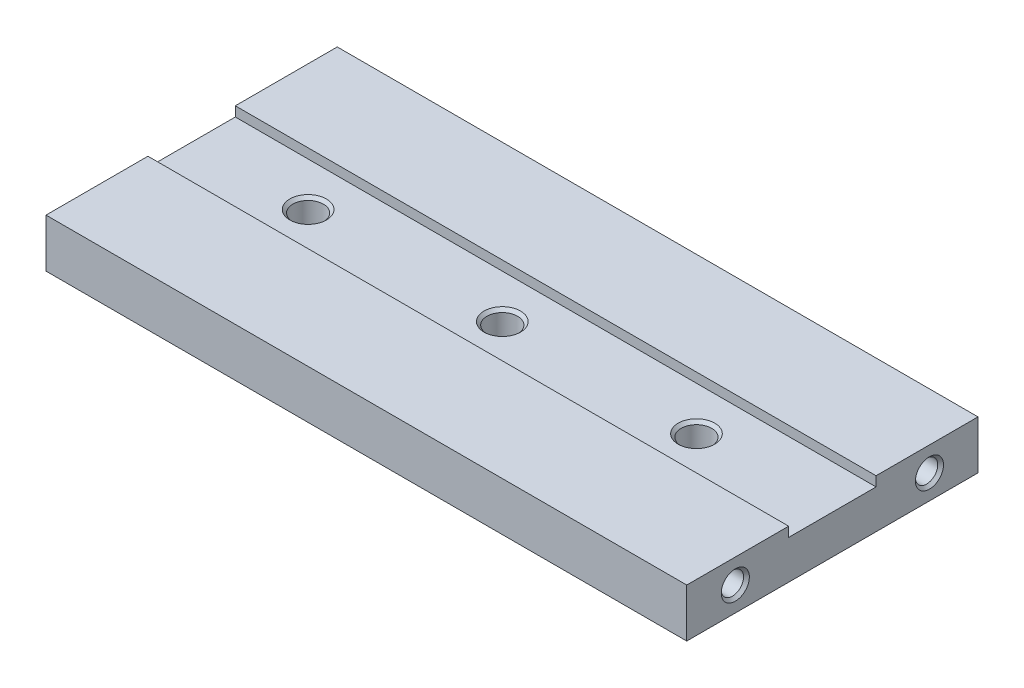
ISO-10303-21;
HEADER;
FILE_DESCRIPTION(('STEP AP214'),'2;1');
FILE_NAME('part.step','',(''),(''),'','','');
FILE_SCHEMA(('AUTOMOTIVE_DESIGN { 1 0 10303 214 1 1 1 1 }'));
ENDSEC;
DATA;
#1=APPLICATION_CONTEXT('core data for automotive mechanical design processes');
#2=APPLICATION_PROTOCOL_DEFINITION('international standard','automotive_design',2000,#1);
#3=PRODUCT_CONTEXT('',#1,'mechanical');
#4=PRODUCT('Part','Part','',(#3));
#5=PRODUCT_RELATED_PRODUCT_CATEGORY('part','',(#4));
#6=PRODUCT_DEFINITION_FORMATION('','',#4);
#7=PRODUCT_DEFINITION_CONTEXT('part definition',#1,'design');
#8=PRODUCT_DEFINITION('design','',#6,#7);
#9=PRODUCT_DEFINITION_SHAPE('','',#8);
#10=(LENGTH_UNIT() NAMED_UNIT(*) SI_UNIT(.MILLI.,.METRE.));
#11=(NAMED_UNIT(*) PLANE_ANGLE_UNIT() SI_UNIT($,.RADIAN.));
#12=(NAMED_UNIT(*) SI_UNIT($,.STERADIAN.) SOLID_ANGLE_UNIT());
#13=UNCERTAINTY_MEASURE_WITH_UNIT(LENGTH_MEASURE(1.E-05),#10,'distance_accuracy_value','');
#14=(GEOMETRIC_REPRESENTATION_CONTEXT(3) GLOBAL_UNCERTAINTY_ASSIGNED_CONTEXT((#13)) GLOBAL_UNIT_ASSIGNED_CONTEXT((#10,
#11,#12)) REPRESENTATION_CONTEXT('',''));
#15=CARTESIAN_POINT('',(0.,0.,0.));
#16=DIRECTION('',(0.,0.,1.));
#17=DIRECTION('',(1.,0.,0.));
#18=AXIS2_PLACEMENT_3D('',#15,#16,#17);
#19=CARTESIAN_POINT('',(0.,5.,0.));
#20=DIRECTION('',(0.,1.,0.));
#21=DIRECTION('',(0.,0.,1.));
#22=AXIS2_PLACEMENT_3D('',#19,#20,#21);
#23=PLANE('',#22);
#24=DIRECTION('',(-1.,0.,0.));
#25=VECTOR('',#24,1.);
#26=CARTESIAN_POINT('',(33.,5.,-4.5));
#27=LINE('',#26,#25);
#28=CARTESIAN_POINT('',(33.,5.,-4.5));
#29=VERTEX_POINT('',#28);
#30=CARTESIAN_POINT('',(-33.,5.,-4.5));
#31=VERTEX_POINT('',#30);
#32=EDGE_CURVE('E191',#29,#31,#27,.T.);
#33=ORIENTED_EDGE('',*,*,#32,.F.);
#34=DIRECTION('',(0.,0.,-1.));
#35=VECTOR('',#34,1.);
#36=CARTESIAN_POINT('',(33.,5.,15.));
#37=LINE('',#36,#35);
#38=CARTESIAN_POINT('',(33.,5.,-15.));
#39=VERTEX_POINT('',#38);
#40=EDGE_CURVE('E226',#29,#39,#37,.T.);
#41=ORIENTED_EDGE('',*,*,#40,.T.);
#42=DIRECTION('',(-1.,0.,0.));
#43=VECTOR('',#42,1.);
#44=CARTESIAN_POINT('',(33.,5.,-15.));
#45=LINE('',#44,#43);
#46=CARTESIAN_POINT('',(-33.,5.,-15.));
#47=VERTEX_POINT('',#46);
#48=EDGE_CURVE('E69',#39,#47,#45,.T.);
#49=ORIENTED_EDGE('',*,*,#48,.T.);
#50=DIRECTION('',(0.,0.,1.));
#51=VECTOR('',#50,1.);
#52=CARTESIAN_POINT('',(-33.,5.,15.));
#53=LINE('',#52,#51);
#54=EDGE_CURVE('E220',#47,#31,#53,.T.);
#55=ORIENTED_EDGE('',*,*,#54,.T.);
#56=EDGE_LOOP('',(#33,#41,#49,#55));
#57=FACE_BOUND('',#56,.T.);
#58=ADVANCED_FACE('F44',(#57),#23,.T.);
#59=CARTESIAN_POINT('',(-33.,5.,15.));
#60=DIRECTION('',(1.,0.,0.));
#61=DIRECTION('',(0.,0.,-1.));
#62=AXIS2_PLACEMENT_3D('',#59,#60,#61);
#63=PLANE('',#62);
#64=CARTESIAN_POINT('',(-33.,2.5,-9.99999999999999));
#65=DIRECTION('',(-1.,0.,0.));
#66=DIRECTION('',(0.,0.,1.));
#67=AXIS2_PLACEMENT_3D('',#64,#65,#66);
#68=CIRCLE('',#67,1.4475);
#69=CARTESIAN_POINT('',(-33.,2.5,-8.55249999999999));
#70=VERTEX_POINT('',#69);
#71=EDGE_CURVE('E150',#70,#70,#68,.T.);
#72=ORIENTED_EDGE('',*,*,#71,.F.);
#73=EDGE_LOOP('',(#72));
#74=FACE_BOUND('',#73,.T.);
#75=CARTESIAN_POINT('',(-33.,2.5,10.));
#76=DIRECTION('',(-1.,0.,0.));
#77=DIRECTION('',(0.,0.,1.));
#78=AXIS2_PLACEMENT_3D('',#75,#76,#77);
#79=CIRCLE('',#78,1.4475);
#80=CARTESIAN_POINT('',(-33.,2.5,11.4475));
#81=VERTEX_POINT('',#80);
#82=EDGE_CURVE('E141',#81,#81,#79,.T.);
#83=ORIENTED_EDGE('',*,*,#82,.F.);
#84=EDGE_LOOP('',(#83));
#85=FACE_BOUND('',#84,.T.);
#86=DIRECTION('',(0.,0.,1.));
#87=VECTOR('',#86,1.);
#88=CARTESIAN_POINT('',(-33.,4.,4.5));
#89=LINE('',#88,#87);
#90=CARTESIAN_POINT('',(-33.,4.,-4.5));
#91=VERTEX_POINT('',#90);
#92=CARTESIAN_POINT('',(-33.,4.,4.5));
#93=VERTEX_POINT('',#92);
#94=EDGE_CURVE('E186',#91,#93,#89,.T.);
#95=ORIENTED_EDGE('',*,*,#94,.F.);
#96=DIRECTION('',(0.,1.,0.));
#97=VECTOR('',#96,1.);
#98=CARTESIAN_POINT('',(-33.,4.,-4.5));
#99=LINE('',#98,#97);
#100=EDGE_CURVE('E206',#91,#31,#99,.T.);
#101=ORIENTED_EDGE('',*,*,#100,.T.);
#102=ORIENTED_EDGE('',*,*,#54,.F.);
#103=DIRECTION('',(0.,-1.,0.));
#104=VECTOR('',#103,1.);
#105=CARTESIAN_POINT('',(-33.,5.,-15.));
#106=LINE('',#105,#104);
#107=CARTESIAN_POINT('',(-33.,0.,-15.));
#108=VERTEX_POINT('',#107);
#109=EDGE_CURVE('E233',#47,#108,#106,.T.);
#110=ORIENTED_EDGE('',*,*,#109,.T.);
#111=DIRECTION('',(0.,0.,1.));
#112=VECTOR('',#111,1.);
#113=CARTESIAN_POINT('',(-33.,0.,15.));
#114=LINE('',#113,#112);
#115=CARTESIAN_POINT('',(-33.,0.,15.));
#116=VERTEX_POINT('',#115);
#117=EDGE_CURVE('E210',#108,#116,#114,.T.);
#118=ORIENTED_EDGE('',*,*,#117,.T.);
#119=DIRECTION('',(0.,-1.,0.));
#120=VECTOR('',#119,1.);
#121=CARTESIAN_POINT('',(-33.,5.,15.));
#122=LINE('',#121,#120);
#123=CARTESIAN_POINT('',(-33.,5.,15.));
#124=VERTEX_POINT('',#123);
#125=EDGE_CURVE('E11',#124,#116,#122,.T.);
#126=ORIENTED_EDGE('',*,*,#125,.F.);
#127=CARTESIAN_POINT('',(-33.,5.,4.5));
#128=VERTEX_POINT('',#127);
#129=EDGE_CURVE('E97',#128,#124,#53,.T.);
#130=ORIENTED_EDGE('',*,*,#129,.F.);
#131=DIRECTION('',(0.,1.,0.));
#132=VECTOR('',#131,1.);
#133=CARTESIAN_POINT('',(-33.,4.,4.5));
#134=LINE('',#133,#132);
#135=EDGE_CURVE('E60',#93,#128,#134,.T.);
#136=ORIENTED_EDGE('',*,*,#135,.F.);
#137=EDGE_LOOP('',(#95,#101,#102,#110,#118,#126,#130,#136));
#138=FACE_BOUND('',#137,.T.);
#139=ADVANCED_FACE('F46',(#74,#85,#138),#63,.F.);
#140=CARTESIAN_POINT('',(33.,5.,15.));
#141=DIRECTION('',(0.,0.,-1.));
#142=DIRECTION('',(-1.,0.,0.));
#143=AXIS2_PLACEMENT_3D('',#140,#141,#142);
#144=PLANE('',#143);
#145=DIRECTION('',(1.,0.,0.));
#146=VECTOR('',#145,1.);
#147=CARTESIAN_POINT('',(33.,0.,15.));
#148=LINE('',#147,#146);
#149=CARTESIAN_POINT('',(33.,0.,15.));
#150=VERTEX_POINT('',#149);
#151=EDGE_CURVE('E237',#116,#150,#148,.T.);
#152=ORIENTED_EDGE('',*,*,#151,.T.);
#153=DIRECTION('',(0.,-1.,0.));
#154=VECTOR('',#153,1.);
#155=CARTESIAN_POINT('',(33.,5.,15.));
#156=LINE('',#155,#154);
#157=CARTESIAN_POINT('',(33.,5.,15.));
#158=VERTEX_POINT('',#157);
#159=EDGE_CURVE('E53',#158,#150,#156,.T.);
#160=ORIENTED_EDGE('',*,*,#159,.F.);
#161=DIRECTION('',(1.,0.,0.));
#162=VECTOR('',#161,1.);
#163=CARTESIAN_POINT('',(33.,5.,15.));
#164=LINE('',#163,#162);
#165=EDGE_CURVE('E223',#124,#158,#164,.T.);
#166=ORIENTED_EDGE('',*,*,#165,.F.);
#167=ORIENTED_EDGE('',*,*,#125,.T.);
#168=EDGE_LOOP('',(#152,#160,#166,#167));
#169=FACE_BOUND('',#168,.T.);
#170=ADVANCED_FACE('F278',(#169),#144,.F.);
#171=CARTESIAN_POINT('',(33.,5.,15.));
#172=DIRECTION('',(-1.,0.,0.));
#173=DIRECTION('',(0.,0.,1.));
#174=AXIS2_PLACEMENT_3D('',#171,#172,#173);
#175=PLANE('',#174);
#176=CARTESIAN_POINT('',(33.,2.5,9.99999999999999));
#177=DIRECTION('',(1.,0.,0.));
#178=DIRECTION('',(0.,0.,-1.));
#179=AXIS2_PLACEMENT_3D('',#176,#177,#178);
#180=CIRCLE('',#179,1.4475);
#181=CARTESIAN_POINT('',(33.,2.5,8.5525));
#182=VERTEX_POINT('',#181);
#183=EDGE_CURVE('E161',#182,#182,#180,.T.);
#184=ORIENTED_EDGE('',*,*,#183,.F.);
#185=EDGE_LOOP('',(#184));
#186=FACE_BOUND('',#185,.T.);
#187=CARTESIAN_POINT('',(33.,2.5,-10.));
#188=DIRECTION('',(1.,0.,0.));
#189=DIRECTION('',(0.,0.,-1.));
#190=AXIS2_PLACEMENT_3D('',#187,#188,#189);
#191=CIRCLE('',#190,1.4475);
#192=CARTESIAN_POINT('',(33.,2.5,-11.4475));
#193=VERTEX_POINT('',#192);
#194=EDGE_CURVE('E173',#193,#193,#191,.T.);
#195=ORIENTED_EDGE('',*,*,#194,.F.);
#196=EDGE_LOOP('',(#195));
#197=FACE_BOUND('',#196,.T.);
#198=ORIENTED_EDGE('',*,*,#40,.F.);
#199=DIRECTION('',(0.,1.,0.));
#200=VECTOR('',#199,1.);
#201=CARTESIAN_POINT('',(33.,4.,-4.5));
#202=LINE('',#201,#200);
#203=CARTESIAN_POINT('',(33.,4.,-4.5));
#204=VERTEX_POINT('',#203);
#205=EDGE_CURVE('E211',#204,#29,#202,.T.);
#206=ORIENTED_EDGE('',*,*,#205,.F.);
#207=DIRECTION('',(0.,0.,-1.));
#208=VECTOR('',#207,1.);
#209=CARTESIAN_POINT('',(33.,4.,4.5));
#210=LINE('',#209,#208);
#211=CARTESIAN_POINT('',(33.,4.,4.5));
#212=VERTEX_POINT('',#211);
#213=EDGE_CURVE('E195',#212,#204,#210,.T.);
#214=ORIENTED_EDGE('',*,*,#213,.F.);
#215=DIRECTION('',(0.,1.,0.));
#216=VECTOR('',#215,1.);
#217=CARTESIAN_POINT('',(33.,4.,4.5));
#218=LINE('',#217,#216);
#219=CARTESIAN_POINT('',(33.,5.,4.5));
#220=VERTEX_POINT('',#219);
#221=EDGE_CURVE('E214',#212,#220,#218,.T.);
#222=ORIENTED_EDGE('',*,*,#221,.T.);
#223=EDGE_CURVE('E227',#158,#220,#37,.T.);
#224=ORIENTED_EDGE('',*,*,#223,.F.);
#225=ORIENTED_EDGE('',*,*,#159,.T.);
#226=DIRECTION('',(0.,0.,-1.));
#227=VECTOR('',#226,1.);
#228=CARTESIAN_POINT('',(33.,0.,15.));
#229=LINE('',#228,#227);
#230=CARTESIAN_POINT('',(33.,0.,-15.));
#231=VERTEX_POINT('',#230);
#232=EDGE_CURVE('E240',#150,#231,#229,.T.);
#233=ORIENTED_EDGE('',*,*,#232,.T.);
#234=DIRECTION('',(0.,-1.,0.));
#235=VECTOR('',#234,1.);
#236=CARTESIAN_POINT('',(33.,5.,-15.));
#237=LINE('',#236,#235);
#238=EDGE_CURVE('E247',#39,#231,#237,.T.);
#239=ORIENTED_EDGE('',*,*,#238,.F.);
#240=EDGE_LOOP('',(#198,#206,#214,#222,#224,#225,#233,#239));
#241=FACE_BOUND('',#240,.T.);
#242=ADVANCED_FACE('F256',(#186,#197,#241),#175,.F.);
#243=CARTESIAN_POINT('',(33.,5.,-15.));
#244=DIRECTION('',(0.,0.,1.));
#245=DIRECTION('',(1.,0.,0.));
#246=AXIS2_PLACEMENT_3D('',#243,#244,#245);
#247=PLANE('',#246);
#248=DIRECTION('',(-1.,0.,0.));
#249=VECTOR('',#248,1.);
#250=CARTESIAN_POINT('',(33.,0.,-15.));
#251=LINE('',#250,#249);
#252=EDGE_CURVE('E90',#231,#108,#251,.T.);
#253=ORIENTED_EDGE('',*,*,#252,.T.);
#254=ORIENTED_EDGE('',*,*,#109,.F.);
#255=ORIENTED_EDGE('',*,*,#48,.F.);
#256=ORIENTED_EDGE('',*,*,#238,.T.);
#257=EDGE_LOOP('',(#253,#254,#255,#256));
#258=FACE_BOUND('',#257,.T.);
#259=ADVANCED_FACE('F266',(#258),#247,.F.);
#260=DIRECTION('',(1.,0.,0.));
#261=VECTOR('',#260,1.);
#262=CARTESIAN_POINT('',(33.,5.,4.5));
#263=LINE('',#262,#261);
#264=EDGE_CURVE('E185',#128,#220,#263,.T.);
#265=ORIENTED_EDGE('',*,*,#264,.F.);
#266=ORIENTED_EDGE('',*,*,#129,.T.);
#267=ORIENTED_EDGE('',*,*,#165,.T.);
#268=ORIENTED_EDGE('',*,*,#223,.T.);
#269=EDGE_LOOP('',(#265,#266,#267,#268));
#270=FACE_BOUND('',#269,.T.);
#271=ADVANCED_FACE('F277',(#270),#23,.T.);
#272=CARTESIAN_POINT('',(0.,0.,0.));
#273=DIRECTION('',(0.,1.,0.));
#274=DIRECTION('',(0.,0.,1.));
#275=AXIS2_PLACEMENT_3D('',#272,#273,#274);
#276=PLANE('',#275);
#277=CARTESIAN_POINT('',(-21.,0.,0.));
#278=DIRECTION('',(0.,1.,0.));
#279=DIRECTION('',(0.,0.,1.));
#280=AXIS2_PLACEMENT_3D('',#277,#278,#279);
#281=CIRCLE('',#280,1.575);
#282=CARTESIAN_POINT('',(-21.,0.,1.575));
#283=VERTEX_POINT('',#282);
#284=EDGE_CURVE('E622',#283,#283,#281,.T.);
#285=ORIENTED_EDGE('',*,*,#284,.T.);
#286=EDGE_LOOP('',(#285));
#287=FACE_BOUND('',#286,.T.);
#288=CARTESIAN_POINT('',(-1.,0.,0.));
#289=DIRECTION('',(0.,1.,0.));
#290=DIRECTION('',(0.,0.,1.));
#291=AXIS2_PLACEMENT_3D('',#288,#289,#290);
#292=CIRCLE('',#291,1.575);
#293=CARTESIAN_POINT('',(-1.,0.,1.575));
#294=VERTEX_POINT('',#293);
#295=EDGE_CURVE('E636',#294,#294,#292,.T.);
#296=ORIENTED_EDGE('',*,*,#295,.T.);
#297=EDGE_LOOP('',(#296));
#298=FACE_BOUND('',#297,.T.);
#299=CARTESIAN_POINT('',(19.,0.,0.));
#300=DIRECTION('',(0.,1.,0.));
#301=DIRECTION('',(0.,0.,1.));
#302=AXIS2_PLACEMENT_3D('',#299,#300,#301);
#303=CIRCLE('',#302,1.575);
#304=CARTESIAN_POINT('',(19.,0.,1.575));
#305=VERTEX_POINT('',#304);
#306=EDGE_CURVE('E648',#305,#305,#303,.T.);
#307=ORIENTED_EDGE('',*,*,#306,.T.);
#308=EDGE_LOOP('',(#307));
#309=FACE_BOUND('',#308,.T.);
#310=ORIENTED_EDGE('',*,*,#117,.F.);
#311=ORIENTED_EDGE('',*,*,#252,.F.);
#312=ORIENTED_EDGE('',*,*,#232,.F.);
#313=ORIENTED_EDGE('',*,*,#151,.F.);
#314=EDGE_LOOP('',(#310,#311,#312,#313));
#315=FACE_BOUND('',#314,.T.);
#316=ADVANCED_FACE('F261',(#287,#298,#309,#315),#276,.F.);
#317=CARTESIAN_POINT('',(33.,4.,-4.5));
#318=DIRECTION('',(0.,0.,-1.));
#319=DIRECTION('',(-1.,0.,0.));
#320=AXIS2_PLACEMENT_3D('',#317,#318,#319);
#321=PLANE('',#320);
#322=ORIENTED_EDGE('',*,*,#32,.T.);
#323=ORIENTED_EDGE('',*,*,#100,.F.);
#324=DIRECTION('',(-1.,0.,0.));
#325=VECTOR('',#324,1.);
#326=CARTESIAN_POINT('',(33.,4.,-4.5));
#327=LINE('',#326,#325);
#328=EDGE_CURVE('E198',#204,#91,#327,.T.);
#329=ORIENTED_EDGE('',*,*,#328,.F.);
#330=ORIENTED_EDGE('',*,*,#205,.T.);
#331=EDGE_LOOP('',(#322,#323,#329,#330));
#332=FACE_BOUND('',#331,.T.);
#333=ADVANCED_FACE('F273',(#332),#321,.F.);
#334=CARTESIAN_POINT('',(33.,4.,4.5));
#335=DIRECTION('',(0.,0.,1.));
#336=DIRECTION('',(1.,0.,0.));
#337=AXIS2_PLACEMENT_3D('',#334,#335,#336);
#338=PLANE('',#337);
#339=ORIENTED_EDGE('',*,*,#264,.T.);
#340=ORIENTED_EDGE('',*,*,#221,.F.);
#341=DIRECTION('',(1.,0.,0.));
#342=VECTOR('',#341,1.);
#343=CARTESIAN_POINT('',(33.,4.,4.5));
#344=LINE('',#343,#342);
#345=EDGE_CURVE('E190',#93,#212,#344,.T.);
#346=ORIENTED_EDGE('',*,*,#345,.F.);
#347=ORIENTED_EDGE('',*,*,#135,.T.);
#348=EDGE_LOOP('',(#339,#340,#346,#347));
#349=FACE_BOUND('',#348,.T.);
#350=ADVANCED_FACE('F313',(#349),#338,.F.);
#351=CARTESIAN_POINT('',(0.,4.,0.));
#352=DIRECTION('',(0.,1.,0.));
#353=DIRECTION('',(0.,0.,1.));
#354=AXIS2_PLACEMENT_3D('',#351,#352,#353);
#355=PLANE('',#354);
#356=CARTESIAN_POINT('',(-21.,4.,0.));
#357=DIRECTION('',(0.,1.,0.));
#358=DIRECTION('',(0.,0.,1.));
#359=AXIS2_PLACEMENT_3D('',#356,#357,#358);
#360=CIRCLE('',#359,1.883);
#361=CARTESIAN_POINT('',(-21.,4.,1.883));
#362=VERTEX_POINT('',#361);
#363=EDGE_CURVE('E618',#362,#362,#360,.T.);
#364=ORIENTED_EDGE('',*,*,#363,.F.);
#365=EDGE_LOOP('',(#364));
#366=FACE_BOUND('',#365,.T.);
#367=CARTESIAN_POINT('',(-1.,4.,0.));
#368=DIRECTION('',(0.,1.,0.));
#369=DIRECTION('',(0.,0.,1.));
#370=AXIS2_PLACEMENT_3D('',#367,#368,#369);
#371=CIRCLE('',#370,1.883);
#372=CARTESIAN_POINT('',(-1.,4.,1.883));
#373=VERTEX_POINT('',#372);
#374=EDGE_CURVE('E628',#373,#373,#371,.T.);
#375=ORIENTED_EDGE('',*,*,#374,.F.);
#376=EDGE_LOOP('',(#375));
#377=FACE_BOUND('',#376,.T.);
#378=CARTESIAN_POINT('',(19.,4.,0.));
#379=DIRECTION('',(0.,1.,0.));
#380=DIRECTION('',(0.,0.,1.));
#381=AXIS2_PLACEMENT_3D('',#378,#379,#380);
#382=CIRCLE('',#381,1.883);
#383=CARTESIAN_POINT('',(19.,4.,1.883));
#384=VERTEX_POINT('',#383);
#385=EDGE_CURVE('E640',#384,#384,#382,.T.);
#386=ORIENTED_EDGE('',*,*,#385,.F.);
#387=EDGE_LOOP('',(#386));
#388=FACE_BOUND('',#387,.T.);
#389=ORIENTED_EDGE('',*,*,#94,.T.);
#390=ORIENTED_EDGE('',*,*,#345,.T.);
#391=ORIENTED_EDGE('',*,*,#213,.T.);
#392=ORIENTED_EDGE('',*,*,#328,.T.);
#393=EDGE_LOOP('',(#389,#390,#391,#392));
#394=FACE_BOUND('',#393,.T.);
#395=ADVANCED_FACE('F276',(#366,#377,#388,#394),#355,.T.);
#396=CARTESIAN_POINT('',(27.,2.5,-10.));
#397=DIRECTION('',(1.,0.,0.));
#398=DIRECTION('',(0.,0.,-1.));
#399=AXIS2_PLACEMENT_3D('',#396,#397,#398);
#400=CONICAL_SURFACE('',#399,1.15,1.02974425867665);
#401=CARTESIAN_POINT('',(26.3090102881183,2.5,-10.));
#402=VERTEX_POINT('',#401);
#403=VERTEX_LOOP('',#402);
#404=FACE_BOUND('',#403,.T.);
#405=CARTESIAN_POINT('',(27.,2.5,-10.));
#406=DIRECTION('',(1.,0.,0.));
#407=DIRECTION('',(0.,0.,-1.));
#408=AXIS2_PLACEMENT_3D('',#405,#406,#407);
#409=CIRCLE('',#408,1.15);
#410=CARTESIAN_POINT('',(27.,2.5,-11.15));
#411=VERTEX_POINT('',#410);
#412=EDGE_CURVE('E181',#411,#411,#409,.T.);
#413=ORIENTED_EDGE('',*,*,#412,.T.);
#414=EDGE_LOOP('',(#413));
#415=FACE_BOUND('',#414,.T.);
#416=ADVANCED_FACE('F318',(#404,#415),#400,.F.);
#417=CARTESIAN_POINT('',(33.,2.5,-10.));
#418=DIRECTION('',(1.,0.,0.));
#419=DIRECTION('',(0.,0.,-1.));
#420=AXIS2_PLACEMENT_3D('',#417,#418,#419);
#421=CYLINDRICAL_SURFACE('',#420,1.15);
#422=ORIENTED_EDGE('',*,*,#412,.F.);
#423=EDGE_LOOP('',(#422));
#424=FACE_BOUND('',#423,.T.);
#425=CARTESIAN_POINT('',(32.7025,2.5,-10.));
#426=DIRECTION('',(1.,0.,0.));
#427=DIRECTION('',(0.,0.,-1.));
#428=AXIS2_PLACEMENT_3D('',#425,#426,#427);
#429=CIRCLE('',#428,1.15);
#430=CARTESIAN_POINT('',(32.7025,2.5,-11.15));
#431=VERTEX_POINT('',#430);
#432=EDGE_CURVE('E177',#431,#431,#429,.T.);
#433=ORIENTED_EDGE('',*,*,#432,.T.);
#434=EDGE_LOOP('',(#433));
#435=FACE_BOUND('',#434,.T.);
#436=ADVANCED_FACE('F323',(#424,#435),#421,.F.);
#437=CARTESIAN_POINT('',(33.,2.5,-10.));
#438=DIRECTION('',(1.,0.,0.));
#439=DIRECTION('',(0.,0.,-1.));
#440=AXIS2_PLACEMENT_3D('',#437,#438,#439);
#441=CONICAL_SURFACE('',#440,1.4475,0.785398163397451);
#442=ORIENTED_EDGE('',*,*,#432,.F.);
#443=EDGE_LOOP('',(#442));
#444=FACE_BOUND('',#443,.T.);
#445=ORIENTED_EDGE('',*,*,#194,.T.);
#446=EDGE_LOOP('',(#445));
#447=FACE_BOUND('',#446,.T.);
#448=ADVANCED_FACE('F336',(#444,#447),#441,.F.);
#449=CARTESIAN_POINT('',(27.,2.5,9.99999999999999));
#450=DIRECTION('',(1.,0.,0.));
#451=DIRECTION('',(0.,0.,-1.));
#452=AXIS2_PLACEMENT_3D('',#449,#450,#451);
#453=CONICAL_SURFACE('',#452,1.15,1.02974425867665);
#454=CARTESIAN_POINT('',(26.3090102881183,2.5,9.99999999999999));
#455=VERTEX_POINT('',#454);
#456=VERTEX_LOOP('',#455);
#457=FACE_BOUND('',#456,.T.);
#458=CARTESIAN_POINT('',(27.,2.5,9.99999999999999));
#459=DIRECTION('',(1.,0.,0.));
#460=DIRECTION('',(0.,0.,-1.));
#461=AXIS2_PLACEMENT_3D('',#458,#459,#460);
#462=CIRCLE('',#461,1.15);
#463=CARTESIAN_POINT('',(27.,2.5,8.85));
#464=VERTEX_POINT('',#463);
#465=EDGE_CURVE('E169',#464,#464,#462,.T.);
#466=ORIENTED_EDGE('',*,*,#465,.T.);
#467=EDGE_LOOP('',(#466));
#468=FACE_BOUND('',#467,.T.);
#469=ADVANCED_FACE('F349',(#457,#468),#453,.F.);
#470=CARTESIAN_POINT('',(33.,2.5,9.99999999999999));
#471=DIRECTION('',(1.,0.,0.));
#472=DIRECTION('',(0.,0.,-1.));
#473=AXIS2_PLACEMENT_3D('',#470,#471,#472);
#474=CYLINDRICAL_SURFACE('',#473,1.15);
#475=ORIENTED_EDGE('',*,*,#465,.F.);
#476=EDGE_LOOP('',(#475));
#477=FACE_BOUND('',#476,.T.);
#478=CARTESIAN_POINT('',(32.7025,2.5,9.99999999999999));
#479=DIRECTION('',(1.,0.,0.));
#480=DIRECTION('',(0.,0.,-1.));
#481=AXIS2_PLACEMENT_3D('',#478,#479,#480);
#482=CIRCLE('',#481,1.15);
#483=CARTESIAN_POINT('',(32.7025,2.5,8.85));
#484=VERTEX_POINT('',#483);
#485=EDGE_CURVE('E165',#484,#484,#482,.T.);
#486=ORIENTED_EDGE('',*,*,#485,.T.);
#487=EDGE_LOOP('',(#486));
#488=FACE_BOUND('',#487,.T.);
#489=ADVANCED_FACE('F361',(#477,#488),#474,.F.);
#490=CARTESIAN_POINT('',(33.,2.5,9.99999999999999));
#491=DIRECTION('',(1.,0.,0.));
#492=DIRECTION('',(0.,0.,-1.));
#493=AXIS2_PLACEMENT_3D('',#490,#491,#492);
#494=CONICAL_SURFACE('',#493,1.4475,0.785398163397451);
#495=ORIENTED_EDGE('',*,*,#485,.F.);
#496=EDGE_LOOP('',(#495));
#497=FACE_BOUND('',#496,.T.);
#498=ORIENTED_EDGE('',*,*,#183,.T.);
#499=EDGE_LOOP('',(#498));
#500=FACE_BOUND('',#499,.T.);
#501=ADVANCED_FACE('F371',(#497,#500),#494,.F.);
#502=CARTESIAN_POINT('',(-27.,2.5,10.));
#503=DIRECTION('',(-1.,0.,0.));
#504=DIRECTION('',(0.,0.,1.));
#505=AXIS2_PLACEMENT_3D('',#502,#503,#504);
#506=CONICAL_SURFACE('',#505,1.15,1.02974425867665);
#507=CARTESIAN_POINT('',(-26.3090102881183,2.5,10.));
#508=VERTEX_POINT('',#507);
#509=VERTEX_LOOP('',#508);
#510=FACE_BOUND('',#509,.T.);
#511=CARTESIAN_POINT('',(-27.,2.5,10.));
#512=DIRECTION('',(-1.,0.,0.));
#513=DIRECTION('',(0.,0.,1.));
#514=AXIS2_PLACEMENT_3D('',#511,#512,#513);
#515=CIRCLE('',#514,1.15);
#516=CARTESIAN_POINT('',(-27.,2.5,11.15));
#517=VERTEX_POINT('',#516);
#518=EDGE_CURVE('E157',#517,#517,#515,.T.);
#519=ORIENTED_EDGE('',*,*,#518,.T.);
#520=EDGE_LOOP('',(#519));
#521=FACE_BOUND('',#520,.T.);
#522=ADVANCED_FACE('F384',(#510,#521),#506,.F.);
#523=CARTESIAN_POINT('',(-33.,2.5,10.));
#524=DIRECTION('',(-1.,0.,0.));
#525=DIRECTION('',(0.,0.,1.));
#526=AXIS2_PLACEMENT_3D('',#523,#524,#525);
#527=CYLINDRICAL_SURFACE('',#526,1.15);
#528=ORIENTED_EDGE('',*,*,#518,.F.);
#529=EDGE_LOOP('',(#528));
#530=FACE_BOUND('',#529,.T.);
#531=CARTESIAN_POINT('',(-32.7025,2.5,10.));
#532=DIRECTION('',(-1.,0.,0.));
#533=DIRECTION('',(0.,0.,1.));
#534=AXIS2_PLACEMENT_3D('',#531,#532,#533);
#535=CIRCLE('',#534,1.15);
#536=CARTESIAN_POINT('',(-32.7025,2.5,11.15));
#537=VERTEX_POINT('',#536);
#538=EDGE_CURVE('E147',#537,#537,#535,.T.);
#539=ORIENTED_EDGE('',*,*,#538,.T.);
#540=EDGE_LOOP('',(#539));
#541=FACE_BOUND('',#540,.T.);
#542=ADVANCED_FACE('F400',(#530,#541),#527,.F.);
#543=CARTESIAN_POINT('',(-33.,2.5,10.));
#544=DIRECTION('',(-1.,0.,0.));
#545=DIRECTION('',(0.,0.,1.));
#546=AXIS2_PLACEMENT_3D('',#543,#544,#545);
#547=CONICAL_SURFACE('',#546,1.4475,0.785398163397451);
#548=ORIENTED_EDGE('',*,*,#538,.F.);
#549=EDGE_LOOP('',(#548));
#550=FACE_BOUND('',#549,.T.);
#551=ORIENTED_EDGE('',*,*,#82,.T.);
#552=EDGE_LOOP('',(#551));
#553=FACE_BOUND('',#552,.T.);
#554=ADVANCED_FACE('F134',(#550,#553),#547,.F.);
#555=CARTESIAN_POINT('',(-27.,2.5,-9.99999999999999));
#556=DIRECTION('',(-1.,0.,0.));
#557=DIRECTION('',(0.,0.,1.));
#558=AXIS2_PLACEMENT_3D('',#555,#556,#557);
#559=CONICAL_SURFACE('',#558,1.15,1.02974425867665);
#560=CARTESIAN_POINT('',(-26.3090102881183,2.5,-9.99999999999999));
#561=VERTEX_POINT('',#560);
#562=VERTEX_LOOP('',#561);
#563=FACE_BOUND('',#562,.T.);
#564=CARTESIAN_POINT('',(-27.,2.5,-9.99999999999999));
#565=DIRECTION('',(-1.,0.,0.));
#566=DIRECTION('',(0.,0.,1.));
#567=AXIS2_PLACEMENT_3D('',#564,#565,#566);
#568=CIRCLE('',#567,1.15);
#569=CARTESIAN_POINT('',(-27.,2.5,-8.84999999999999));
#570=VERTEX_POINT('',#569);
#571=EDGE_CURVE('E138',#570,#570,#568,.T.);
#572=ORIENTED_EDGE('',*,*,#571,.T.);
#573=EDGE_LOOP('',(#572));
#574=FACE_BOUND('',#573,.T.);
#575=ADVANCED_FACE('F130',(#563,#574),#559,.F.);
#576=CARTESIAN_POINT('',(-33.,2.5,-9.99999999999999));
#577=DIRECTION('',(-1.,0.,0.));
#578=DIRECTION('',(0.,0.,1.));
#579=AXIS2_PLACEMENT_3D('',#576,#577,#578);
#580=CYLINDRICAL_SURFACE('',#579,1.15);
#581=ORIENTED_EDGE('',*,*,#571,.F.);
#582=EDGE_LOOP('',(#581));
#583=FACE_BOUND('',#582,.T.);
#584=CARTESIAN_POINT('',(-32.7025,2.5,-9.99999999999999));
#585=DIRECTION('',(-1.,0.,0.));
#586=DIRECTION('',(0.,0.,1.));
#587=AXIS2_PLACEMENT_3D('',#584,#585,#586);
#588=CIRCLE('',#587,1.15);
#589=CARTESIAN_POINT('',(-32.7025,2.5,-8.84999999999999));
#590=VERTEX_POINT('',#589);
#591=EDGE_CURVE('E142',#590,#590,#588,.T.);
#592=ORIENTED_EDGE('',*,*,#591,.T.);
#593=EDGE_LOOP('',(#592));
#594=FACE_BOUND('',#593,.T.);
#595=ADVANCED_FACE('F133',(#583,#594),#580,.F.);
#596=CARTESIAN_POINT('',(-33.,2.5,-9.99999999999999));
#597=DIRECTION('',(-1.,0.,0.));
#598=DIRECTION('',(0.,0.,1.));
#599=AXIS2_PLACEMENT_3D('',#596,#597,#598);
#600=CONICAL_SURFACE('',#599,1.4475,0.785398163397451);
#601=ORIENTED_EDGE('',*,*,#591,.F.);
#602=EDGE_LOOP('',(#601));
#603=FACE_BOUND('',#602,.T.);
#604=ORIENTED_EDGE('',*,*,#71,.T.);
#605=EDGE_LOOP('',(#604));
#606=FACE_BOUND('',#605,.T.);
#607=ADVANCED_FACE('F439',(#603,#606),#600,.F.);
#608=CARTESIAN_POINT('',(19.,4.,0.));
#609=DIRECTION('',(0.,1.,0.));
#610=DIRECTION('',(0.,0.,1.));
#611=AXIS2_PLACEMENT_3D('',#608,#609,#610);
#612=CYLINDRICAL_SURFACE('',#611,1.57499999999999);
#613=ORIENTED_EDGE('',*,*,#306,.F.);
#614=EDGE_LOOP('',(#613));
#615=FACE_BOUND('',#614,.T.);
#616=CARTESIAN_POINT('',(19.,3.69200000000001,0.));
#617=DIRECTION('',(0.,1.,0.));
#618=DIRECTION('',(0.,0.,1.));
#619=AXIS2_PLACEMENT_3D('',#616,#617,#618);
#620=CIRCLE('',#619,1.57499999999999);
#621=CARTESIAN_POINT('',(19.,3.69200000000001,1.57499999999999));
#622=VERTEX_POINT('',#621);
#623=EDGE_CURVE('E644',#622,#622,#620,.T.);
#624=ORIENTED_EDGE('',*,*,#623,.T.);
#625=EDGE_LOOP('',(#624));
#626=FACE_BOUND('',#625,.T.);
#627=ADVANCED_FACE('F451',(#615,#626),#612,.F.);
#628=CARTESIAN_POINT('',(19.,4.,0.));
#629=DIRECTION('',(0.,1.,0.));
#630=DIRECTION('',(0.,0.,1.));
#631=AXIS2_PLACEMENT_3D('',#628,#629,#630);
#632=CONICAL_SURFACE('',#631,1.883,0.785398163397479);
#633=ORIENTED_EDGE('',*,*,#623,.F.);
#634=EDGE_LOOP('',(#633));
#635=FACE_BOUND('',#634,.T.);
#636=ORIENTED_EDGE('',*,*,#385,.T.);
#637=EDGE_LOOP('',(#636));
#638=FACE_BOUND('',#637,.T.);
#639=ADVANCED_FACE('F483',(#635,#638),#632,.F.);
#640=CARTESIAN_POINT('',(-1.,4.,0.));
#641=DIRECTION('',(0.,1.,0.));
#642=DIRECTION('',(0.,0.,1.));
#643=AXIS2_PLACEMENT_3D('',#640,#641,#642);
#644=CYLINDRICAL_SURFACE('',#643,1.57499999999999);
#645=ORIENTED_EDGE('',*,*,#295,.F.);
#646=EDGE_LOOP('',(#645));
#647=FACE_BOUND('',#646,.T.);
#648=CARTESIAN_POINT('',(-1.,3.69200000000001,0.));
#649=DIRECTION('',(0.,1.,0.));
#650=DIRECTION('',(0.,0.,1.));
#651=AXIS2_PLACEMENT_3D('',#648,#649,#650);
#652=CIRCLE('',#651,1.57499999999999);
#653=CARTESIAN_POINT('',(-1.,3.69200000000001,1.57499999999999));
#654=VERTEX_POINT('',#653);
#655=EDGE_CURVE('E632',#654,#654,#652,.T.);
#656=ORIENTED_EDGE('',*,*,#655,.T.);
#657=EDGE_LOOP('',(#656));
#658=FACE_BOUND('',#657,.T.);
#659=ADVANCED_FACE('F494',(#647,#658),#644,.F.);
#660=CARTESIAN_POINT('',(-1.,4.,0.));
#661=DIRECTION('',(0.,1.,0.));
#662=DIRECTION('',(0.,0.,1.));
#663=AXIS2_PLACEMENT_3D('',#660,#661,#662);
#664=CONICAL_SURFACE('',#663,1.883,0.785398163397482);
#665=ORIENTED_EDGE('',*,*,#655,.F.);
#666=EDGE_LOOP('',(#665));
#667=FACE_BOUND('',#666,.T.);
#668=ORIENTED_EDGE('',*,*,#374,.T.);
#669=EDGE_LOOP('',(#668));
#670=FACE_BOUND('',#669,.T.);
#671=ADVANCED_FACE('F505',(#667,#670),#664,.F.);
#672=CARTESIAN_POINT('',(-21.,4.,0.));
#673=DIRECTION('',(0.,1.,0.));
#674=DIRECTION('',(0.,0.,1.));
#675=AXIS2_PLACEMENT_3D('',#672,#673,#674);
#676=CYLINDRICAL_SURFACE('',#675,1.57499999999999);
#677=ORIENTED_EDGE('',*,*,#284,.F.);
#678=EDGE_LOOP('',(#677));
#679=FACE_BOUND('',#678,.T.);
#680=CARTESIAN_POINT('',(-21.,3.69200000000001,0.));
#681=DIRECTION('',(0.,1.,0.));
#682=DIRECTION('',(0.,0.,1.));
#683=AXIS2_PLACEMENT_3D('',#680,#681,#682);
#684=CIRCLE('',#683,1.57499999999999);
#685=CARTESIAN_POINT('',(-21.,3.69200000000001,1.57499999999999));
#686=VERTEX_POINT('',#685);
#687=EDGE_CURVE('E615',#686,#686,#684,.T.);
#688=ORIENTED_EDGE('',*,*,#687,.T.);
#689=EDGE_LOOP('',(#688));
#690=FACE_BOUND('',#689,.T.);
#691=ADVANCED_FACE('F518',(#679,#690),#676,.F.);
#692=CARTESIAN_POINT('',(-21.,4.,0.));
#693=DIRECTION('',(0.,1.,0.));
#694=DIRECTION('',(0.,0.,1.));
#695=AXIS2_PLACEMENT_3D('',#692,#693,#694);
#696=CONICAL_SURFACE('',#695,1.883,0.785398163397479);
#697=ORIENTED_EDGE('',*,*,#687,.F.);
#698=EDGE_LOOP('',(#697));
#699=FACE_BOUND('',#698,.T.);
#700=ORIENTED_EDGE('',*,*,#363,.T.);
#701=EDGE_LOOP('',(#700));
#702=FACE_BOUND('',#701,.T.);
#703=ADVANCED_FACE('F528',(#699,#702),#696,.F.);
#704=CLOSED_SHELL('',(#58,#139,#170,#242,#259,#271,#316,#333,#350,#395,#416,#436,#448,#469,#489,
#501,#522,#542,#554,#575,#595,#607,#627,#639,#659,#671,#691,#703));
#705=MANIFOLD_SOLID_BREP('B2',#704);
#706=ADVANCED_BREP_SHAPE_REPRESENTATION('',(#18,#705),#14);
#707=SHAPE_DEFINITION_REPRESENTATION(#9,#706);
ENDSEC;
END-ISO-10303-21;
